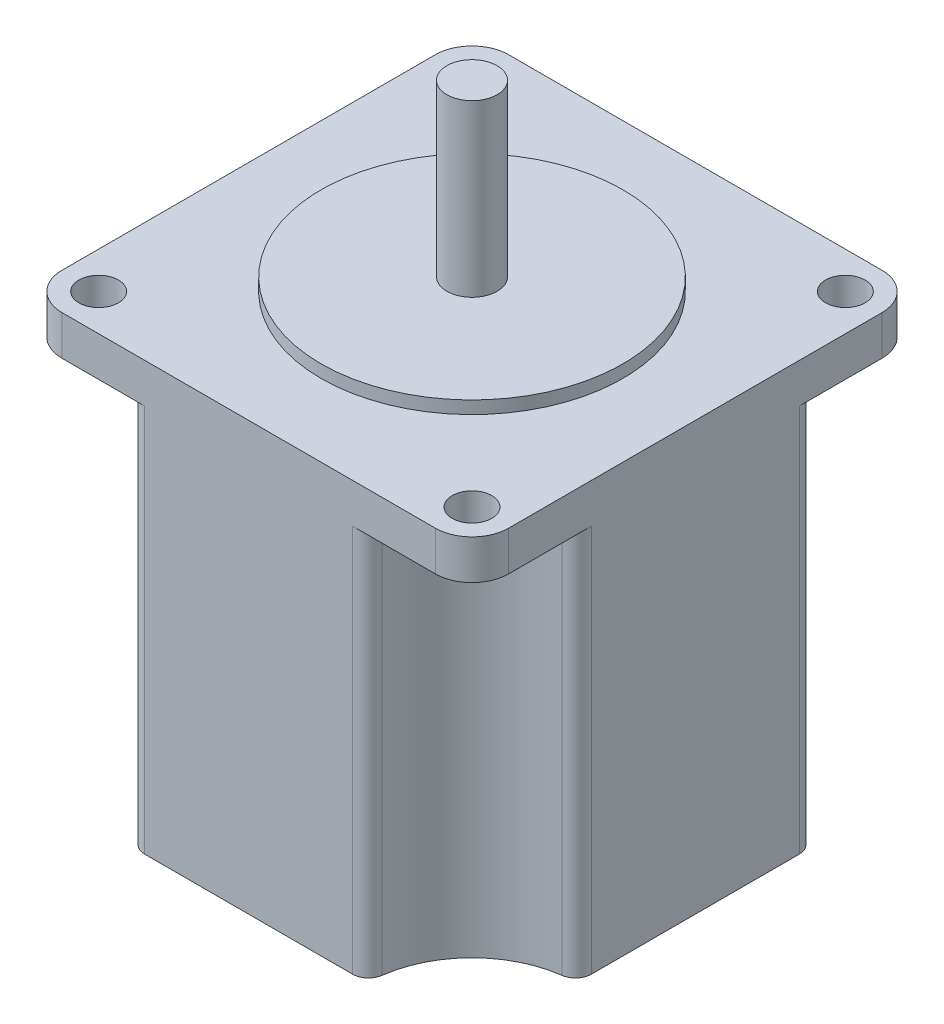
ISO-10303-21;
HEADER;
FILE_DESCRIPTION(('STEP AP214'),'2;1');
FILE_NAME('part.step','',(''),(''),'','','');
FILE_SCHEMA(('AUTOMOTIVE_DESIGN { 1 0 10303 214 1 1 1 1 }'));
ENDSEC;
DATA;
#1=APPLICATION_CONTEXT('core data for automotive mechanical design processes');
#2=APPLICATION_PROTOCOL_DEFINITION('international standard','automotive_design',2000,#1);
#3=PRODUCT_CONTEXT('',#1,'mechanical');
#4=PRODUCT('Part','Part','',(#3));
#5=PRODUCT_RELATED_PRODUCT_CATEGORY('part','',(#4));
#6=PRODUCT_DEFINITION_FORMATION('','',#4);
#7=PRODUCT_DEFINITION_CONTEXT('part definition',#1,'design');
#8=PRODUCT_DEFINITION('design','',#6,#7);
#9=PRODUCT_DEFINITION_SHAPE('','',#8);
#10=(LENGTH_UNIT() NAMED_UNIT(*) SI_UNIT(.MILLI.,.METRE.));
#11=(NAMED_UNIT(*) PLANE_ANGLE_UNIT() SI_UNIT($,.RADIAN.));
#12=(NAMED_UNIT(*) SI_UNIT($,.STERADIAN.) SOLID_ANGLE_UNIT());
#13=UNCERTAINTY_MEASURE_WITH_UNIT(LENGTH_MEASURE(1.E-05),#10,'distance_accuracy_value','');
#14=(GEOMETRIC_REPRESENTATION_CONTEXT(3) GLOBAL_UNCERTAINTY_ASSIGNED_CONTEXT((#13)) GLOBAL_UNIT_ASSIGNED_CONTEXT((#10,
#11,#12)) REPRESENTATION_CONTEXT('',''));
#15=CARTESIAN_POINT('',(0.,0.,0.));
#16=DIRECTION('',(0.,0.,1.));
#17=DIRECTION('',(1.,0.,0.));
#18=AXIS2_PLACEMENT_3D('',#15,#16,#17);
#19=CARTESIAN_POINT('',(28.2,55.6,-28.2));
#20=DIRECTION('',(0.,1.,0.));
#21=DIRECTION('',(0.,0.,1.));
#22=AXIS2_PLACEMENT_3D('',#19,#20,#21);
#23=PLANE('',#22);
#24=CARTESIAN_POINT('',(28.2,55.6,-28.2));
#25=DIRECTION('',(0.,1.,0.));
#26=DIRECTION('',(0.,0.,1.));
#27=AXIS2_PLACEMENT_3D('',#24,#25,#26);
#28=CIRCLE('',#27,19.05);
#29=CARTESIAN_POINT('',(28.2,55.6,-9.14999999999999));
#30=VERTEX_POINT('',#29);
#31=EDGE_CURVE('E367',#30,#30,#28,.T.);
#32=ORIENTED_EDGE('',*,*,#31,.T.);
#33=EDGE_LOOP('',(#32));
#34=FACE_BOUND('',#33,.T.);
#35=CARTESIAN_POINT('',(28.2,55.6,-28.2));
#36=DIRECTION('',(0.,1.,0.));
#37=DIRECTION('',(0.,0.,1.));
#38=AXIS2_PLACEMENT_3D('',#35,#36,#37);
#39=CIRCLE('',#38,3.175);
#40=CARTESIAN_POINT('',(28.2,55.6,-25.025));
#41=VERTEX_POINT('',#40);
#42=EDGE_CURVE('E623',#41,#41,#39,.T.);
#43=ORIENTED_EDGE('',*,*,#42,.F.);
#44=EDGE_LOOP('',(#43));
#45=FACE_BOUND('',#44,.T.);
#46=ADVANCED_FACE('F34',(#34,#45),#23,.T.);
#47=CARTESIAN_POINT('',(4.63,54.,-51.77));
#48=DIRECTION('',(0.,1.,0.));
#49=DIRECTION('',(0.,0.,1.));
#50=AXIS2_PLACEMENT_3D('',#47,#48,#49);
#51=PLANE('',#50);
#52=CARTESIAN_POINT('',(4.63,54.,-51.77));
#53=DIRECTION('',(0.,1.,0.));
#54=DIRECTION('',(0.,0.,1.));
#55=AXIS2_PLACEMENT_3D('',#52,#53,#54);
#56=CIRCLE('',#55,4.63);
#57=CARTESIAN_POINT('',(4.63,54.,-56.4));
#58=VERTEX_POINT('',#57);
#59=CARTESIAN_POINT('',(0.,54.,-51.77));
#60=VERTEX_POINT('',#59);
#61=EDGE_CURVE('E269',#58,#60,#56,.T.);
#62=ORIENTED_EDGE('',*,*,#61,.T.);
#63=DIRECTION('',(0.,0.,1.));
#64=VECTOR('',#63,1.);
#65=CARTESIAN_POINT('',(0.,54.,-51.77));
#66=LINE('',#65,#64);
#67=CARTESIAN_POINT('',(0.,54.,-4.63));
#68=VERTEX_POINT('',#67);
#69=EDGE_CURVE('E272',#60,#68,#66,.T.);
#70=ORIENTED_EDGE('',*,*,#69,.T.);
#71=CARTESIAN_POINT('',(4.63,54.,-4.63));
#72=DIRECTION('',(0.,1.,0.));
#73=DIRECTION('',(0.,0.,-1.));
#74=AXIS2_PLACEMENT_3D('',#71,#72,#73);
#75=CIRCLE('',#74,4.63);
#76=CARTESIAN_POINT('',(4.63,54.,0.));
#77=VERTEX_POINT('',#76);
#78=EDGE_CURVE('E275',#68,#77,#75,.T.);
#79=ORIENTED_EDGE('',*,*,#78,.T.);
#80=DIRECTION('',(1.,0.,0.));
#81=VECTOR('',#80,1.);
#82=CARTESIAN_POINT('',(4.63,54.,0.));
#83=LINE('',#82,#81);
#84=CARTESIAN_POINT('',(51.77,54.,0.));
#85=VERTEX_POINT('',#84);
#86=EDGE_CURVE('E277',#77,#85,#83,.T.);
#87=ORIENTED_EDGE('',*,*,#86,.T.);
#88=CARTESIAN_POINT('',(51.77,54.,-4.63));
#89=DIRECTION('',(0.,1.,0.));
#90=DIRECTION('',(0.,0.,1.));
#91=AXIS2_PLACEMENT_3D('',#88,#89,#90);
#92=CIRCLE('',#91,4.63);
#93=CARTESIAN_POINT('',(56.4,54.,-4.63));
#94=VERTEX_POINT('',#93);
#95=EDGE_CURVE('E279',#85,#94,#92,.T.);
#96=ORIENTED_EDGE('',*,*,#95,.T.);
#97=DIRECTION('',(0.,0.,-1.));
#98=VECTOR('',#97,1.);
#99=CARTESIAN_POINT('',(56.4,54.,-51.77));
#100=LINE('',#99,#98);
#101=CARTESIAN_POINT('',(56.4,54.,-51.77));
#102=VERTEX_POINT('',#101);
#103=EDGE_CURVE('E281',#94,#102,#100,.T.);
#104=ORIENTED_EDGE('',*,*,#103,.T.);
#105=CARTESIAN_POINT('',(51.77,54.,-51.77));
#106=DIRECTION('',(0.,1.,0.));
#107=DIRECTION('',(0.,0.,-1.));
#108=AXIS2_PLACEMENT_3D('',#105,#106,#107);
#109=CIRCLE('',#108,4.63);
#110=CARTESIAN_POINT('',(51.77,54.,-56.4));
#111=VERTEX_POINT('',#110);
#112=EDGE_CURVE('E283',#102,#111,#109,.T.);
#113=ORIENTED_EDGE('',*,*,#112,.T.);
#114=DIRECTION('',(-1.,0.,0.));
#115=VECTOR('',#114,1.);
#116=CARTESIAN_POINT('',(4.63,54.,-56.4));
#117=LINE('',#116,#115);
#118=EDGE_CURVE('E285',#111,#58,#117,.T.);
#119=ORIENTED_EDGE('',*,*,#118,.T.);
#120=EDGE_LOOP('',(#62,#70,#79,#87,#96,#104,#113,#119));
#121=FACE_BOUND('',#120,.T.);
#122=CARTESIAN_POINT('',(4.63,54.,-51.77));
#123=DIRECTION('',(0.,1.,0.));
#124=DIRECTION('',(0.,0.,1.));
#125=AXIS2_PLACEMENT_3D('',#122,#123,#124);
#126=CIRCLE('',#125,2.5);
#127=CARTESIAN_POINT('',(4.63,54.,-49.27));
#128=VERTEX_POINT('',#127);
#129=EDGE_CURVE('E266',#128,#128,#126,.T.);
#130=ORIENTED_EDGE('',*,*,#129,.F.);
#131=EDGE_LOOP('',(#130));
#132=FACE_BOUND('',#131,.T.);
#133=CARTESIAN_POINT('',(51.77,54.,-51.77));
#134=DIRECTION('',(0.,1.,0.));
#135=DIRECTION('',(0.,0.,-1.));
#136=AXIS2_PLACEMENT_3D('',#133,#134,#135);
#137=CIRCLE('',#136,2.5);
#138=CARTESIAN_POINT('',(51.77,54.,-54.27));
#139=VERTEX_POINT('',#138);
#140=EDGE_CURVE('E263',#139,#139,#137,.T.);
#141=ORIENTED_EDGE('',*,*,#140,.F.);
#142=EDGE_LOOP('',(#141));
#143=FACE_BOUND('',#142,.T.);
#144=CARTESIAN_POINT('',(51.77,54.,-4.63000000000001));
#145=DIRECTION('',(0.,1.,0.));
#146=DIRECTION('',(0.,0.,1.));
#147=AXIS2_PLACEMENT_3D('',#144,#145,#146);
#148=CIRCLE('',#147,2.5);
#149=CARTESIAN_POINT('',(51.77,54.,-2.13000000000001));
#150=VERTEX_POINT('',#149);
#151=EDGE_CURVE('E260',#150,#150,#148,.T.);
#152=ORIENTED_EDGE('',*,*,#151,.F.);
#153=EDGE_LOOP('',(#152));
#154=FACE_BOUND('',#153,.T.);
#155=CARTESIAN_POINT('',(4.63,54.,-4.63));
#156=DIRECTION('',(0.,1.,0.));
#157=DIRECTION('',(0.,0.,-1.));
#158=AXIS2_PLACEMENT_3D('',#155,#156,#157);
#159=CIRCLE('',#158,2.5);
#160=CARTESIAN_POINT('',(4.63,54.,-7.13));
#161=VERTEX_POINT('',#160);
#162=EDGE_CURVE('E208',#161,#161,#159,.T.);
#163=ORIENTED_EDGE('',*,*,#162,.F.);
#164=EDGE_LOOP('',(#163));
#165=FACE_BOUND('',#164,.T.);
#166=CARTESIAN_POINT('',(28.2,54.,-28.2));
#167=DIRECTION('',(0.,1.,0.));
#168=DIRECTION('',(0.,0.,1.));
#169=AXIS2_PLACEMENT_3D('',#166,#167,#168);
#170=CIRCLE('',#169,19.05);
#171=CARTESIAN_POINT('',(28.2,54.,-9.14999999999999));
#172=VERTEX_POINT('',#171);
#173=EDGE_CURVE('E622',#172,#172,#170,.T.);
#174=ORIENTED_EDGE('',*,*,#173,.F.);
#175=EDGE_LOOP('',(#174));
#176=FACE_BOUND('',#175,.T.);
#177=ADVANCED_FACE('F322',(#121,#132,#143,#154,#165,#176),#51,.T.);
#178=CARTESIAN_POINT('',(4.63,54.,-51.77));
#179=DIRECTION('',(0.,-1.,0.));
#180=DIRECTION('',(0.,0.,-1.));
#181=AXIS2_PLACEMENT_3D('',#178,#179,#180);
#182=CYLINDRICAL_SURFACE('',#181,4.63);
#183=CARTESIAN_POINT('',(4.63,49.,-51.77));
#184=DIRECTION('',(0.,-1.,0.));
#185=DIRECTION('',(0.,0.,-1.));
#186=AXIS2_PLACEMENT_3D('',#183,#184,#185);
#187=CIRCLE('',#186,4.63);
#188=CARTESIAN_POINT('',(0.,49.,-51.77));
#189=VERTEX_POINT('',#188);
#190=CARTESIAN_POINT('',(4.63,49.,-56.4));
#191=VERTEX_POINT('',#190);
#192=EDGE_CURVE('E250',#189,#191,#187,.T.);
#193=ORIENTED_EDGE('',*,*,#192,.F.);
#194=DIRECTION('',(0.,-1.,0.));
#195=VECTOR('',#194,1.);
#196=CARTESIAN_POINT('',(0.,54.,-51.77));
#197=LINE('',#196,#195);
#198=EDGE_CURVE('E12',#60,#189,#197,.T.);
#199=ORIENTED_EDGE('',*,*,#198,.F.);
#200=ORIENTED_EDGE('',*,*,#61,.F.);
#201=DIRECTION('',(0.,-1.,0.));
#202=VECTOR('',#201,1.);
#203=CARTESIAN_POINT('',(4.63,54.,-56.4));
#204=LINE('',#203,#202);
#205=EDGE_CURVE('E287',#58,#191,#204,.T.);
#206=ORIENTED_EDGE('',*,*,#205,.T.);
#207=EDGE_LOOP('',(#193,#199,#200,#206));
#208=FACE_BOUND('',#207,.T.);
#209=ADVANCED_FACE('F36',(#208),#182,.T.);
#210=CARTESIAN_POINT('',(0.,54.,-51.77));
#211=DIRECTION('',(1.,0.,0.));
#212=DIRECTION('',(0.,0.,-1.));
#213=AXIS2_PLACEMENT_3D('',#210,#211,#212);
#214=PLANE('',#213);
#215=DIRECTION('',(0.,-1.,0.));
#216=VECTOR('',#215,1.);
#217=CARTESIAN_POINT('',(0.,49.,-15.0678465614699));
#218=LINE('',#217,#216);
#219=CARTESIAN_POINT('',(0.,49.,-15.0678465614699));
#220=VERTEX_POINT('',#219);
#221=CARTESIAN_POINT('',(0.,0.,-15.0678465614699));
#222=VERTEX_POINT('',#221);
#223=EDGE_CURVE('E214',#220,#222,#218,.T.);
#224=ORIENTED_EDGE('',*,*,#223,.F.);
#225=DIRECTION('',(0.,0.,-1.));
#226=VECTOR('',#225,1.);
#227=CARTESIAN_POINT('',(0.,49.,-51.77));
#228=LINE('',#227,#226);
#229=CARTESIAN_POINT('',(0.,49.,-4.63));
#230=VERTEX_POINT('',#229);
#231=EDGE_CURVE('E196',#230,#220,#228,.T.);
#232=ORIENTED_EDGE('',*,*,#231,.F.);
#233=DIRECTION('',(0.,-1.,0.));
#234=VECTOR('',#233,1.);
#235=CARTESIAN_POINT('',(0.,54.,-4.63));
#236=LINE('',#235,#234);
#237=EDGE_CURVE('E43',#68,#230,#236,.T.);
#238=ORIENTED_EDGE('',*,*,#237,.F.);
#239=ORIENTED_EDGE('',*,*,#69,.F.);
#240=ORIENTED_EDGE('',*,*,#198,.T.);
#241=CARTESIAN_POINT('',(0.,49.,-41.3321534385301));
#242=VERTEX_POINT('',#241);
#243=EDGE_CURVE('E210',#242,#189,#228,.T.);
#244=ORIENTED_EDGE('',*,*,#243,.F.);
#245=DIRECTION('',(0.,-1.,0.));
#246=VECTOR('',#245,1.);
#247=CARTESIAN_POINT('',(0.,49.,-41.3321534385301));
#248=LINE('',#247,#246);
#249=CARTESIAN_POINT('',(0.,0.,-41.3321534385301));
#250=VERTEX_POINT('',#249);
#251=EDGE_CURVE('E224',#242,#250,#248,.T.);
#252=ORIENTED_EDGE('',*,*,#251,.T.);
#253=DIRECTION('',(0.,0.,1.));
#254=VECTOR('',#253,1.);
#255=CARTESIAN_POINT('',(0.,0.,-51.77));
#256=LINE('',#255,#254);
#257=EDGE_CURVE('E223',#250,#222,#256,.T.);
#258=ORIENTED_EDGE('',*,*,#257,.T.);
#259=EDGE_LOOP('',(#224,#232,#238,#239,#240,#244,#252,#258));
#260=FACE_BOUND('',#259,.T.);
#261=ADVANCED_FACE('F220',(#260),#214,.F.);
#262=CARTESIAN_POINT('',(4.63,54.,-4.63));
#263=DIRECTION('',(0.,-1.,0.));
#264=DIRECTION('',(0.,0.,-1.));
#265=AXIS2_PLACEMENT_3D('',#262,#263,#264);
#266=CYLINDRICAL_SURFACE('',#265,4.63);
#267=CARTESIAN_POINT('',(4.63,49.,-4.63));
#268=DIRECTION('',(0.,-1.,0.));
#269=DIRECTION('',(0.,0.,-1.));
#270=AXIS2_PLACEMENT_3D('',#267,#268,#269);
#271=CIRCLE('',#270,4.63);
#272=CARTESIAN_POINT('',(4.63,49.,0.));
#273=VERTEX_POINT('',#272);
#274=EDGE_CURVE('E203',#273,#230,#271,.T.);
#275=ORIENTED_EDGE('',*,*,#274,.F.);
#276=DIRECTION('',(0.,-1.,0.));
#277=VECTOR('',#276,1.);
#278=CARTESIAN_POINT('',(4.63,54.,0.));
#279=LINE('',#278,#277);
#280=EDGE_CURVE('E311',#77,#273,#279,.T.);
#281=ORIENTED_EDGE('',*,*,#280,.F.);
#282=ORIENTED_EDGE('',*,*,#78,.F.);
#283=ORIENTED_EDGE('',*,*,#237,.T.);
#284=EDGE_LOOP('',(#275,#281,#282,#283));
#285=FACE_BOUND('',#284,.T.);
#286=ADVANCED_FACE('F316',(#285),#266,.T.);
#287=CARTESIAN_POINT('',(51.77,54.,-4.63));
#288=DIRECTION('',(0.,-1.,0.));
#289=DIRECTION('',(0.,0.,-1.));
#290=AXIS2_PLACEMENT_3D('',#287,#288,#289);
#291=CYLINDRICAL_SURFACE('',#290,4.63);
#292=CARTESIAN_POINT('',(51.77,49.,-4.63));
#293=DIRECTION('',(0.,-1.,0.));
#294=DIRECTION('',(0.,0.,-1.));
#295=AXIS2_PLACEMENT_3D('',#292,#293,#294);
#296=CIRCLE('',#295,4.63);
#297=CARTESIAN_POINT('',(56.4,49.,-4.63));
#298=VERTEX_POINT('',#297);
#299=CARTESIAN_POINT('',(51.77,49.,0.));
#300=VERTEX_POINT('',#299);
#301=EDGE_CURVE('E252',#298,#300,#296,.T.);
#302=ORIENTED_EDGE('',*,*,#301,.F.);
#303=DIRECTION('',(0.,-1.,0.));
#304=VECTOR('',#303,1.);
#305=CARTESIAN_POINT('',(56.4,54.,-4.63));
#306=LINE('',#305,#304);
#307=EDGE_CURVE('E305',#94,#298,#306,.T.);
#308=ORIENTED_EDGE('',*,*,#307,.F.);
#309=ORIENTED_EDGE('',*,*,#95,.F.);
#310=DIRECTION('',(0.,-1.,0.));
#311=VECTOR('',#310,1.);
#312=CARTESIAN_POINT('',(51.77,54.,0.));
#313=LINE('',#312,#311);
#314=EDGE_CURVE('E308',#85,#300,#313,.T.);
#315=ORIENTED_EDGE('',*,*,#314,.T.);
#316=EDGE_LOOP('',(#302,#308,#309,#315));
#317=FACE_BOUND('',#316,.T.);
#318=ADVANCED_FACE('F459',(#317),#291,.T.);
#319=CARTESIAN_POINT('',(51.77,54.,-51.77));
#320=DIRECTION('',(0.,-1.,0.));
#321=DIRECTION('',(0.,0.,-1.));
#322=AXIS2_PLACEMENT_3D('',#319,#320,#321);
#323=CYLINDRICAL_SURFACE('',#322,4.63);
#324=CARTESIAN_POINT('',(51.77,49.,-51.77));
#325=DIRECTION('',(0.,-1.,0.));
#326=DIRECTION('',(0.,0.,-1.));
#327=AXIS2_PLACEMENT_3D('',#324,#325,#326);
#328=CIRCLE('',#327,4.63);
#329=CARTESIAN_POINT('',(51.77,49.,-56.4));
#330=VERTEX_POINT('',#329);
#331=CARTESIAN_POINT('',(56.4,49.,-51.77));
#332=VERTEX_POINT('',#331);
#333=EDGE_CURVE('E244',#330,#332,#328,.T.);
#334=ORIENTED_EDGE('',*,*,#333,.F.);
#335=DIRECTION('',(0.,-1.,0.));
#336=VECTOR('',#335,1.);
#337=CARTESIAN_POINT('',(51.77,54.,-56.4));
#338=LINE('',#337,#336);
#339=EDGE_CURVE('E299',#111,#330,#338,.T.);
#340=ORIENTED_EDGE('',*,*,#339,.F.);
#341=ORIENTED_EDGE('',*,*,#112,.F.);
#342=DIRECTION('',(0.,-1.,0.));
#343=VECTOR('',#342,1.);
#344=CARTESIAN_POINT('',(56.4,54.,-51.77));
#345=LINE('',#344,#343);
#346=EDGE_CURVE('E302',#102,#332,#345,.T.);
#347=ORIENTED_EDGE('',*,*,#346,.T.);
#348=EDGE_LOOP('',(#334,#340,#341,#347));
#349=FACE_BOUND('',#348,.T.);
#350=ADVANCED_FACE('F469',(#349),#323,.T.);
#351=CARTESIAN_POINT('',(4.63,0.,-51.77));
#352=DIRECTION('',(0.,1.,0.));
#353=DIRECTION('',(0.,0.,1.));
#354=AXIS2_PLACEMENT_3D('',#351,#352,#353);
#355=PLANE('',#354);
#356=CARTESIAN_POINT('',(2.,0.,-15.0678465614699));
#357=DIRECTION('',(0.,-1.,0.));
#358=DIRECTION('',(0.,0.,-1.));
#359=AXIS2_PLACEMENT_3D('',#356,#357,#358);
#360=CIRCLE('',#359,2.);
#361=CARTESIAN_POINT('',(1.73684210526316,0.,-13.0852351718028));
#362=VERTEX_POINT('',#361);
#363=EDGE_CURVE('E363',#362,#222,#360,.T.);
#364=ORIENTED_EDGE('',*,*,#363,.T.);
#365=ORIENTED_EDGE('',*,*,#257,.F.);
#366=CARTESIAN_POINT('',(2.,0.,-41.3321534385301));
#367=DIRECTION('',(0.,-1.,0.));
#368=DIRECTION('',(0.,0.,1.));
#369=AXIS2_PLACEMENT_3D('',#366,#367,#368);
#370=CIRCLE('',#369,2.);
#371=CARTESIAN_POINT('',(1.73684210526316,0.,-43.3147648281972));
#372=VERTEX_POINT('',#371);
#373=EDGE_CURVE('E355',#250,#372,#370,.T.);
#374=ORIENTED_EDGE('',*,*,#373,.T.);
#375=CARTESIAN_POINT('',(0.,0.,-56.4));
#376=DIRECTION('',(0.,1.,0.));
#377=DIRECTION('',(0.,0.,1.));
#378=AXIS2_PLACEMENT_3D('',#375,#376,#377);
#379=CIRCLE('',#378,13.2);
#380=CARTESIAN_POINT('',(13.0852351718028,0.,-54.6631578947368));
#381=VERTEX_POINT('',#380);
#382=EDGE_CURVE('E362',#372,#381,#379,.T.);
#383=ORIENTED_EDGE('',*,*,#382,.T.);
#384=CARTESIAN_POINT('',(15.0678465614699,0.,-54.4));
#385=DIRECTION('',(0.,-1.,0.));
#386=DIRECTION('',(0.,0.,1.));
#387=AXIS2_PLACEMENT_3D('',#384,#385,#386);
#388=CIRCLE('',#387,2.);
#389=CARTESIAN_POINT('',(15.0678465614699,0.,-56.4));
#390=VERTEX_POINT('',#389);
#391=EDGE_CURVE('E365',#381,#390,#388,.T.);
#392=ORIENTED_EDGE('',*,*,#391,.T.);
#393=DIRECTION('',(-1.,0.,0.));
#394=VECTOR('',#393,1.);
#395=CARTESIAN_POINT('',(4.63,0.,-56.4));
#396=LINE('',#395,#394);
#397=CARTESIAN_POINT('',(41.3321534385301,0.,-56.4));
#398=VERTEX_POINT('',#397);
#399=EDGE_CURVE('E273',#398,#390,#396,.T.);
#400=ORIENTED_EDGE('',*,*,#399,.F.);
#401=CARTESIAN_POINT('',(41.3321534385301,0.,-54.4));
#402=DIRECTION('',(0.,-1.,0.));
#403=DIRECTION('',(0.,0.,-1.));
#404=AXIS2_PLACEMENT_3D('',#401,#402,#403);
#405=CIRCLE('',#404,2.);
#406=CARTESIAN_POINT('',(43.3147648281972,0.,-54.6631578947368));
#407=VERTEX_POINT('',#406);
#408=EDGE_CURVE('E371',#398,#407,#405,.T.);
#409=ORIENTED_EDGE('',*,*,#408,.T.);
#410=CARTESIAN_POINT('',(56.4,0.,-56.4));
#411=DIRECTION('',(0.,1.,0.));
#412=DIRECTION('',(0.,0.,-1.));
#413=AXIS2_PLACEMENT_3D('',#410,#411,#412);
#414=CIRCLE('',#413,13.2);
#415=CARTESIAN_POINT('',(54.6631578947368,0.,-43.3147648281972));
#416=VERTEX_POINT('',#415);
#417=EDGE_CURVE('E374',#407,#416,#414,.T.);
#418=ORIENTED_EDGE('',*,*,#417,.T.);
#419=CARTESIAN_POINT('',(54.4,0.,-41.3321534385301));
#420=DIRECTION('',(0.,-1.,0.));
#421=DIRECTION('',(0.,0.,-1.));
#422=AXIS2_PLACEMENT_3D('',#419,#420,#421);
#423=CIRCLE('',#422,2.);
#424=CARTESIAN_POINT('',(56.4,0.,-41.3321534385301));
#425=VERTEX_POINT('',#424);
#426=EDGE_CURVE('E377',#416,#425,#423,.T.);
#427=ORIENTED_EDGE('',*,*,#426,.T.);
#428=DIRECTION('',(0.,0.,-1.));
#429=VECTOR('',#428,1.);
#430=CARTESIAN_POINT('',(56.4,0.,-51.77));
#431=LINE('',#430,#429);
#432=CARTESIAN_POINT('',(56.4,0.,-15.0678465614699));
#433=VERTEX_POINT('',#432);
#434=EDGE_CURVE('E292',#433,#425,#431,.T.);
#435=ORIENTED_EDGE('',*,*,#434,.F.);
#436=CARTESIAN_POINT('',(54.4,0.,-15.0678465614699));
#437=DIRECTION('',(0.,-1.,0.));
#438=DIRECTION('',(0.,0.,1.));
#439=AXIS2_PLACEMENT_3D('',#436,#437,#438);
#440=CIRCLE('',#439,2.);
#441=CARTESIAN_POINT('',(54.6631578947368,0.,-13.0852351718028));
#442=VERTEX_POINT('',#441);
#443=EDGE_CURVE('E380',#433,#442,#440,.T.);
#444=ORIENTED_EDGE('',*,*,#443,.T.);
#445=CARTESIAN_POINT('',(56.4,0.,0.));
#446=DIRECTION('',(0.,1.,0.));
#447=DIRECTION('',(0.,0.,1.));
#448=AXIS2_PLACEMENT_3D('',#445,#446,#447);
#449=CIRCLE('',#448,13.2);
#450=CARTESIAN_POINT('',(43.3147648281972,0.,-1.73684210526315));
#451=VERTEX_POINT('',#450);
#452=EDGE_CURVE('E58',#442,#451,#449,.T.);
#453=ORIENTED_EDGE('',*,*,#452,.T.);
#454=CARTESIAN_POINT('',(41.3321534385301,0.,-1.99999999999999));
#455=DIRECTION('',(0.,-1.,0.));
#456=DIRECTION('',(0.,0.,1.));
#457=AXIS2_PLACEMENT_3D('',#454,#455,#456);
#458=CIRCLE('',#457,2.);
#459=CARTESIAN_POINT('',(41.3321534385301,0.,0.));
#460=VERTEX_POINT('',#459);
#461=EDGE_CURVE('E384',#451,#460,#458,.T.);
#462=ORIENTED_EDGE('',*,*,#461,.T.);
#463=DIRECTION('',(1.,0.,0.));
#464=VECTOR('',#463,1.);
#465=CARTESIAN_POINT('',(4.63,0.,0.));
#466=LINE('',#465,#464);
#467=CARTESIAN_POINT('',(15.0678465614699,0.,0.));
#468=VERTEX_POINT('',#467);
#469=EDGE_CURVE('E289',#468,#460,#466,.T.);
#470=ORIENTED_EDGE('',*,*,#469,.F.);
#471=CARTESIAN_POINT('',(15.0678465614699,0.,-2.));
#472=DIRECTION('',(0.,-1.,0.));
#473=DIRECTION('',(0.,0.,-1.));
#474=AXIS2_PLACEMENT_3D('',#471,#472,#473);
#475=CIRCLE('',#474,2.);
#476=CARTESIAN_POINT('',(13.0852351718028,0.,-1.73684210526316));
#477=VERTEX_POINT('',#476);
#478=EDGE_CURVE('E387',#468,#477,#475,.T.);
#479=ORIENTED_EDGE('',*,*,#478,.T.);
#480=CARTESIAN_POINT('',(0.,0.,0.));
#481=DIRECTION('',(0.,1.,0.));
#482=DIRECTION('',(0.,0.,-1.));
#483=AXIS2_PLACEMENT_3D('',#480,#481,#482);
#484=CIRCLE('',#483,13.2);
#485=EDGE_CURVE('E50',#477,#362,#484,.T.);
#486=ORIENTED_EDGE('',*,*,#485,.T.);
#487=EDGE_LOOP('',(#364,#365,#374,#383,#392,#400,#409,#418,#427,#435,#444,#453,#462,#470,#479,#486));
#488=FACE_BOUND('',#487,.T.);
#489=ADVANCED_FACE('F361',(#488),#355,.F.);
#490=CARTESIAN_POINT('',(4.63,0.,-51.77));
#491=DIRECTION('',(0.,1.,0.));
#492=DIRECTION('',(0.,0.,1.));
#493=AXIS2_PLACEMENT_3D('',#490,#491,#492);
#494=CYLINDRICAL_SURFACE('',#493,2.5);
#495=ORIENTED_EDGE('',*,*,#129,.T.);
#496=EDGE_LOOP('',(#495));
#497=FACE_BOUND('',#496,.T.);
#498=CARTESIAN_POINT('',(4.63,49.,-51.77));
#499=DIRECTION('',(0.,-1.,0.));
#500=DIRECTION('',(0.,0.,-1.));
#501=AXIS2_PLACEMENT_3D('',#498,#499,#500);
#502=CIRCLE('',#501,2.5);
#503=CARTESIAN_POINT('',(4.63,49.,-54.27));
#504=VERTEX_POINT('',#503);
#505=EDGE_CURVE('E239',#504,#504,#502,.F.);
#506=ORIENTED_EDGE('',*,*,#505,.F.);
#507=EDGE_LOOP('',(#506));
#508=FACE_BOUND('',#507,.T.);
#509=ADVANCED_FACE('F548',(#497,#508),#494,.F.);
#510=CARTESIAN_POINT('',(51.77,0.,-51.77));
#511=DIRECTION('',(0.,1.,0.));
#512=DIRECTION('',(0.,0.,1.));
#513=AXIS2_PLACEMENT_3D('',#510,#511,#512);
#514=CYLINDRICAL_SURFACE('',#513,2.5);
#515=ORIENTED_EDGE('',*,*,#140,.T.);
#516=EDGE_LOOP('',(#515));
#517=FACE_BOUND('',#516,.T.);
#518=CARTESIAN_POINT('',(51.77,49.,-51.77));
#519=DIRECTION('',(0.,-1.,0.));
#520=DIRECTION('',(0.,0.,-1.));
#521=AXIS2_PLACEMENT_3D('',#518,#519,#520);
#522=CIRCLE('',#521,2.5);
#523=CARTESIAN_POINT('',(51.77,49.,-54.27));
#524=VERTEX_POINT('',#523);
#525=EDGE_CURVE('E236',#524,#524,#522,.F.);
#526=ORIENTED_EDGE('',*,*,#525,.F.);
#527=EDGE_LOOP('',(#526));
#528=FACE_BOUND('',#527,.T.);
#529=ADVANCED_FACE('F550',(#517,#528),#514,.F.);
#530=CARTESIAN_POINT('',(51.77,0.,-4.63000000000001));
#531=DIRECTION('',(0.,1.,0.));
#532=DIRECTION('',(0.,0.,1.));
#533=AXIS2_PLACEMENT_3D('',#530,#531,#532);
#534=CYLINDRICAL_SURFACE('',#533,2.5);
#535=ORIENTED_EDGE('',*,*,#151,.T.);
#536=EDGE_LOOP('',(#535));
#537=FACE_BOUND('',#536,.T.);
#538=CARTESIAN_POINT('',(51.77,49.,-4.63000000000001));
#539=DIRECTION('',(0.,-1.,0.));
#540=DIRECTION('',(0.,0.,-1.));
#541=AXIS2_PLACEMENT_3D('',#538,#539,#540);
#542=CIRCLE('',#541,2.5);
#543=CARTESIAN_POINT('',(51.77,49.,-7.13000000000001));
#544=VERTEX_POINT('',#543);
#545=EDGE_CURVE('E233',#544,#544,#542,.F.);
#546=ORIENTED_EDGE('',*,*,#545,.F.);
#547=EDGE_LOOP('',(#546));
#548=FACE_BOUND('',#547,.T.);
#549=ADVANCED_FACE('F557',(#537,#548),#534,.F.);
#550=CARTESIAN_POINT('',(4.63,0.,-4.63));
#551=DIRECTION('',(0.,1.,0.));
#552=DIRECTION('',(0.,0.,1.));
#553=AXIS2_PLACEMENT_3D('',#550,#551,#552);
#554=CYLINDRICAL_SURFACE('',#553,2.5);
#555=ORIENTED_EDGE('',*,*,#162,.T.);
#556=EDGE_LOOP('',(#555));
#557=FACE_BOUND('',#556,.T.);
#558=CARTESIAN_POINT('',(4.63,49.,-4.63));
#559=DIRECTION('',(0.,-1.,0.));
#560=DIRECTION('',(0.,0.,-1.));
#561=AXIS2_PLACEMENT_3D('',#558,#559,#560);
#562=CIRCLE('',#561,2.5);
#563=CARTESIAN_POINT('',(4.63,49.,-7.13));
#564=VERTEX_POINT('',#563);
#565=EDGE_CURVE('E38',#564,#564,#562,.F.);
#566=ORIENTED_EDGE('',*,*,#565,.F.);
#567=EDGE_LOOP('',(#566));
#568=FACE_BOUND('',#567,.T.);
#569=ADVANCED_FACE('F571',(#557,#568),#554,.F.);
#570=CARTESIAN_POINT('',(4.63,54.,0.));
#571=DIRECTION('',(0.,0.,-1.));
#572=DIRECTION('',(-1.,0.,0.));
#573=AXIS2_PLACEMENT_3D('',#570,#571,#572);
#574=PLANE('',#573);
#575=DIRECTION('',(0.,-1.,0.));
#576=VECTOR('',#575,1.);
#577=CARTESIAN_POINT('',(41.3321534385301,49.,0.));
#578=LINE('',#577,#576);
#579=CARTESIAN_POINT('',(41.3321534385301,49.,0.));
#580=VERTEX_POINT('',#579);
#581=EDGE_CURVE('E397',#580,#460,#578,.T.);
#582=ORIENTED_EDGE('',*,*,#581,.F.);
#583=DIRECTION('',(-1.,0.,0.));
#584=VECTOR('',#583,1.);
#585=CARTESIAN_POINT('',(4.63,49.,0.));
#586=LINE('',#585,#584);
#587=EDGE_CURVE('E254',#300,#580,#586,.T.);
#588=ORIENTED_EDGE('',*,*,#587,.F.);
#589=ORIENTED_EDGE('',*,*,#314,.F.);
#590=ORIENTED_EDGE('',*,*,#86,.F.);
#591=ORIENTED_EDGE('',*,*,#280,.T.);
#592=CARTESIAN_POINT('',(15.0678465614699,49.,0.));
#593=VERTEX_POINT('',#592);
#594=EDGE_CURVE('E256',#593,#273,#586,.T.);
#595=ORIENTED_EDGE('',*,*,#594,.F.);
#596=DIRECTION('',(0.,-1.,0.));
#597=VECTOR('',#596,1.);
#598=CARTESIAN_POINT('',(15.0678465614699,49.,0.));
#599=LINE('',#598,#597);
#600=EDGE_CURVE('E394',#593,#468,#599,.T.);
#601=ORIENTED_EDGE('',*,*,#600,.T.);
#602=ORIENTED_EDGE('',*,*,#469,.T.);
#603=EDGE_LOOP('',(#582,#588,#589,#590,#591,#595,#601,#602));
#604=FACE_BOUND('',#603,.T.);
#605=ADVANCED_FACE('F448',(#604),#574,.F.);
#606=CARTESIAN_POINT('',(56.4,54.,-51.77));
#607=DIRECTION('',(-1.,0.,0.));
#608=DIRECTION('',(0.,0.,1.));
#609=AXIS2_PLACEMENT_3D('',#606,#607,#608);
#610=PLANE('',#609);
#611=DIRECTION('',(0.,-1.,0.));
#612=VECTOR('',#611,1.);
#613=CARTESIAN_POINT('',(56.4,49.,-41.3321534385301));
#614=LINE('',#613,#612);
#615=CARTESIAN_POINT('',(56.4,49.,-41.3321534385301));
#616=VERTEX_POINT('',#615);
#617=EDGE_CURVE('E406',#616,#425,#614,.T.);
#618=ORIENTED_EDGE('',*,*,#617,.F.);
#619=DIRECTION('',(0.,0.,1.));
#620=VECTOR('',#619,1.);
#621=CARTESIAN_POINT('',(56.4,49.,-51.77));
#622=LINE('',#621,#620);
#623=EDGE_CURVE('E247',#332,#616,#622,.T.);
#624=ORIENTED_EDGE('',*,*,#623,.F.);
#625=ORIENTED_EDGE('',*,*,#346,.F.);
#626=ORIENTED_EDGE('',*,*,#103,.F.);
#627=ORIENTED_EDGE('',*,*,#307,.T.);
#628=CARTESIAN_POINT('',(56.4,49.,-15.0678465614699));
#629=VERTEX_POINT('',#628);
#630=EDGE_CURVE('E249',#629,#298,#622,.T.);
#631=ORIENTED_EDGE('',*,*,#630,.F.);
#632=DIRECTION('',(0.,-1.,0.));
#633=VECTOR('',#632,1.);
#634=CARTESIAN_POINT('',(56.4,49.,-15.0678465614699));
#635=LINE('',#634,#633);
#636=EDGE_CURVE('E403',#629,#433,#635,.T.);
#637=ORIENTED_EDGE('',*,*,#636,.T.);
#638=ORIENTED_EDGE('',*,*,#434,.T.);
#639=EDGE_LOOP('',(#618,#624,#625,#626,#627,#631,#637,#638));
#640=FACE_BOUND('',#639,.T.);
#641=ADVANCED_FACE('F463',(#640),#610,.F.);
#642=CARTESIAN_POINT('',(4.63,54.,-56.4));
#643=DIRECTION('',(0.,0.,1.));
#644=DIRECTION('',(1.,0.,0.));
#645=AXIS2_PLACEMENT_3D('',#642,#643,#644);
#646=PLANE('',#645);
#647=DIRECTION('',(0.,-1.,0.));
#648=VECTOR('',#647,1.);
#649=CARTESIAN_POINT('',(15.0678465614699,49.,-56.4));
#650=LINE('',#649,#648);
#651=CARTESIAN_POINT('',(15.0678465614699,49.,-56.4));
#652=VERTEX_POINT('',#651);
#653=EDGE_CURVE('E336',#652,#390,#650,.T.);
#654=ORIENTED_EDGE('',*,*,#653,.F.);
#655=DIRECTION('',(1.,0.,0.));
#656=VECTOR('',#655,1.);
#657=CARTESIAN_POINT('',(4.63,49.,-56.4));
#658=LINE('',#657,#656);
#659=EDGE_CURVE('E245',#191,#652,#658,.T.);
#660=ORIENTED_EDGE('',*,*,#659,.F.);
#661=ORIENTED_EDGE('',*,*,#205,.F.);
#662=ORIENTED_EDGE('',*,*,#118,.F.);
#663=ORIENTED_EDGE('',*,*,#339,.T.);
#664=CARTESIAN_POINT('',(41.3321534385301,49.,-56.4));
#665=VERTEX_POINT('',#664);
#666=EDGE_CURVE('E242',#665,#330,#658,.T.);
#667=ORIENTED_EDGE('',*,*,#666,.F.);
#668=DIRECTION('',(0.,-1.,0.));
#669=VECTOR('',#668,1.);
#670=CARTESIAN_POINT('',(41.3321534385301,49.,-56.4));
#671=LINE('',#670,#669);
#672=EDGE_CURVE('E342',#665,#398,#671,.T.);
#673=ORIENTED_EDGE('',*,*,#672,.T.);
#674=ORIENTED_EDGE('',*,*,#399,.T.);
#675=EDGE_LOOP('',(#654,#660,#661,#662,#663,#667,#673,#674));
#676=FACE_BOUND('',#675,.T.);
#677=ADVANCED_FACE('F335',(#676),#646,.F.);
#678=CARTESIAN_POINT('',(28.2,49.,-28.2));
#679=DIRECTION('',(0.,-1.,0.));
#680=DIRECTION('',(0.,0.,-1.));
#681=AXIS2_PLACEMENT_3D('',#678,#679,#680);
#682=PLANE('',#681);
#683=ORIENTED_EDGE('',*,*,#565,.T.);
#684=EDGE_LOOP('',(#683));
#685=FACE_BOUND('',#684,.T.);
#686=ORIENTED_EDGE('',*,*,#231,.T.);
#687=CARTESIAN_POINT('',(2.,49.,-15.0678465614699));
#688=DIRECTION('',(0.,-1.,0.));
#689=DIRECTION('',(0.,0.,-1.));
#690=AXIS2_PLACEMENT_3D('',#687,#688,#689);
#691=CIRCLE('',#690,2.);
#692=CARTESIAN_POINT('',(1.73684210526316,49.,-13.0852351718028));
#693=VERTEX_POINT('',#692);
#694=EDGE_CURVE('E200',#693,#220,#691,.T.);
#695=ORIENTED_EDGE('',*,*,#694,.F.);
#696=CARTESIAN_POINT('',(0.,49.,0.));
#697=DIRECTION('',(0.,1.,0.));
#698=DIRECTION('',(0.,0.,-1.));
#699=AXIS2_PLACEMENT_3D('',#696,#697,#698);
#700=CIRCLE('',#699,13.2);
#701=CARTESIAN_POINT('',(13.0852351718028,49.,-1.73684210526316));
#702=VERTEX_POINT('',#701);
#703=EDGE_CURVE('E225',#702,#693,#700,.T.);
#704=ORIENTED_EDGE('',*,*,#703,.F.);
#705=CARTESIAN_POINT('',(15.0678465614699,49.,-2.));
#706=DIRECTION('',(0.,-1.,0.));
#707=DIRECTION('',(0.,0.,-1.));
#708=AXIS2_PLACEMENT_3D('',#705,#706,#707);
#709=CIRCLE('',#708,2.);
#710=EDGE_CURVE('E229',#593,#702,#709,.T.);
#711=ORIENTED_EDGE('',*,*,#710,.F.);
#712=ORIENTED_EDGE('',*,*,#594,.T.);
#713=ORIENTED_EDGE('',*,*,#274,.T.);
#714=EDGE_LOOP('',(#686,#695,#704,#711,#712,#713));
#715=FACE_BOUND('',#714,.T.);
#716=ADVANCED_FACE('F198',(#685,#715),#682,.T.);
#717=CARTESIAN_POINT('',(15.0678465614699,49.,-2.));
#718=DIRECTION('',(0.,-1.,0.));
#719=DIRECTION('',(0.,0.,-1.));
#720=AXIS2_PLACEMENT_3D('',#717,#718,#719);
#721=CYLINDRICAL_SURFACE('',#720,2.);
#722=ORIENTED_EDGE('',*,*,#478,.F.);
#723=ORIENTED_EDGE('',*,*,#600,.F.);
#724=ORIENTED_EDGE('',*,*,#710,.T.);
#725=DIRECTION('',(0.,-1.,0.));
#726=VECTOR('',#725,1.);
#727=CARTESIAN_POINT('',(13.0852351718028,49.,-1.73684210526316));
#728=LINE('',#727,#726);
#729=EDGE_CURVE('E392',#702,#477,#728,.T.);
#730=ORIENTED_EDGE('',*,*,#729,.T.);
#731=EDGE_LOOP('',(#722,#723,#724,#730));
#732=FACE_BOUND('',#731,.T.);
#733=ADVANCED_FACE('F444',(#732),#721,.T.);
#734=CARTESIAN_POINT('',(0.,49.,0.));
#735=DIRECTION('',(0.,-1.,0.));
#736=DIRECTION('',(0.,0.,-1.));
#737=AXIS2_PLACEMENT_3D('',#734,#735,#736);
#738=CYLINDRICAL_SURFACE('',#737,13.2);
#739=ORIENTED_EDGE('',*,*,#485,.F.);
#740=ORIENTED_EDGE('',*,*,#729,.F.);
#741=ORIENTED_EDGE('',*,*,#703,.T.);
#742=DIRECTION('',(0.,-1.,0.));
#743=VECTOR('',#742,1.);
#744=CARTESIAN_POINT('',(1.73684210526316,49.,-13.0852351718028));
#745=LINE('',#744,#743);
#746=EDGE_CURVE('E216',#693,#362,#745,.T.);
#747=ORIENTED_EDGE('',*,*,#746,.T.);
#748=EDGE_LOOP('',(#739,#740,#741,#747));
#749=FACE_BOUND('',#748,.T.);
#750=ADVANCED_FACE('F517',(#749),#738,.F.);
#751=CARTESIAN_POINT('',(2.,49.,-15.0678465614699));
#752=DIRECTION('',(0.,-1.,0.));
#753=DIRECTION('',(0.,0.,-1.));
#754=AXIS2_PLACEMENT_3D('',#751,#752,#753);
#755=CYLINDRICAL_SURFACE('',#754,2.);
#756=ORIENTED_EDGE('',*,*,#363,.F.);
#757=ORIENTED_EDGE('',*,*,#746,.F.);
#758=ORIENTED_EDGE('',*,*,#694,.T.);
#759=ORIENTED_EDGE('',*,*,#223,.T.);
#760=EDGE_LOOP('',(#756,#757,#758,#759));
#761=FACE_BOUND('',#760,.T.);
#762=ADVANCED_FACE('F213',(#761),#755,.T.);
#763=ORIENTED_EDGE('',*,*,#545,.T.);
#764=EDGE_LOOP('',(#763));
#765=FACE_BOUND('',#764,.T.);
#766=ORIENTED_EDGE('',*,*,#587,.T.);
#767=CARTESIAN_POINT('',(41.3321534385301,49.,-1.99999999999999));
#768=DIRECTION('',(0.,-1.,0.));
#769=DIRECTION('',(0.,0.,1.));
#770=AXIS2_PLACEMENT_3D('',#767,#768,#769);
#771=CIRCLE('',#770,2.);
#772=CARTESIAN_POINT('',(43.3147648281972,49.,-1.73684210526315));
#773=VERTEX_POINT('',#772);
#774=EDGE_CURVE('E438',#773,#580,#771,.T.);
#775=ORIENTED_EDGE('',*,*,#774,.F.);
#776=CARTESIAN_POINT('',(56.4,49.,0.));
#777=DIRECTION('',(0.,1.,0.));
#778=DIRECTION('',(0.,0.,1.));
#779=AXIS2_PLACEMENT_3D('',#776,#777,#778);
#780=CIRCLE('',#779,13.2);
#781=CARTESIAN_POINT('',(54.6631578947368,49.,-13.0852351718028));
#782=VERTEX_POINT('',#781);
#783=EDGE_CURVE('E435',#782,#773,#780,.T.);
#784=ORIENTED_EDGE('',*,*,#783,.F.);
#785=CARTESIAN_POINT('',(54.4,49.,-15.0678465614699));
#786=DIRECTION('',(0.,-1.,0.));
#787=DIRECTION('',(0.,0.,1.));
#788=AXIS2_PLACEMENT_3D('',#785,#786,#787);
#789=CIRCLE('',#788,2.);
#790=EDGE_CURVE('E432',#629,#782,#789,.T.);
#791=ORIENTED_EDGE('',*,*,#790,.F.);
#792=ORIENTED_EDGE('',*,*,#630,.T.);
#793=ORIENTED_EDGE('',*,*,#301,.T.);
#794=EDGE_LOOP('',(#766,#775,#784,#791,#792,#793));
#795=FACE_BOUND('',#794,.T.);
#796=ADVANCED_FACE('F484',(#765,#795),#682,.T.);
#797=CARTESIAN_POINT('',(54.4,49.,-15.0678465614699));
#798=DIRECTION('',(0.,-1.,0.));
#799=DIRECTION('',(0.,0.,-1.));
#800=AXIS2_PLACEMENT_3D('',#797,#798,#799);
#801=CYLINDRICAL_SURFACE('',#800,2.);
#802=ORIENTED_EDGE('',*,*,#443,.F.);
#803=ORIENTED_EDGE('',*,*,#636,.F.);
#804=ORIENTED_EDGE('',*,*,#790,.T.);
#805=DIRECTION('',(0.,-1.,0.));
#806=VECTOR('',#805,1.);
#807=CARTESIAN_POINT('',(54.6631578947368,49.,-13.0852351718028));
#808=LINE('',#807,#806);
#809=EDGE_CURVE('E401',#782,#442,#808,.T.);
#810=ORIENTED_EDGE('',*,*,#809,.T.);
#811=EDGE_LOOP('',(#802,#803,#804,#810));
#812=FACE_BOUND('',#811,.T.);
#813=ADVANCED_FACE('F481',(#812),#801,.T.);
#814=CARTESIAN_POINT('',(56.4,49.,0.));
#815=DIRECTION('',(0.,-1.,0.));
#816=DIRECTION('',(0.,0.,-1.));
#817=AXIS2_PLACEMENT_3D('',#814,#815,#816);
#818=CYLINDRICAL_SURFACE('',#817,13.2);
#819=ORIENTED_EDGE('',*,*,#452,.F.);
#820=ORIENTED_EDGE('',*,*,#809,.F.);
#821=ORIENTED_EDGE('',*,*,#783,.T.);
#822=DIRECTION('',(0.,-1.,0.));
#823=VECTOR('',#822,1.);
#824=CARTESIAN_POINT('',(43.3147648281972,49.,-1.73684210526315));
#825=LINE('',#824,#823);
#826=EDGE_CURVE('E399',#773,#451,#825,.T.);
#827=ORIENTED_EDGE('',*,*,#826,.T.);
#828=EDGE_LOOP('',(#819,#820,#821,#827));
#829=FACE_BOUND('',#828,.T.);
#830=ADVANCED_FACE('F486',(#829),#818,.F.);
#831=CARTESIAN_POINT('',(41.3321534385301,49.,-1.99999999999999));
#832=DIRECTION('',(0.,-1.,0.));
#833=DIRECTION('',(0.,0.,-1.));
#834=AXIS2_PLACEMENT_3D('',#831,#832,#833);
#835=CYLINDRICAL_SURFACE('',#834,2.);
#836=ORIENTED_EDGE('',*,*,#461,.F.);
#837=ORIENTED_EDGE('',*,*,#826,.F.);
#838=ORIENTED_EDGE('',*,*,#774,.T.);
#839=ORIENTED_EDGE('',*,*,#581,.T.);
#840=EDGE_LOOP('',(#836,#837,#838,#839));
#841=FACE_BOUND('',#840,.T.);
#842=ADVANCED_FACE('F489',(#841),#835,.T.);
#843=ORIENTED_EDGE('',*,*,#525,.T.);
#844=EDGE_LOOP('',(#843));
#845=FACE_BOUND('',#844,.T.);
#846=ORIENTED_EDGE('',*,*,#623,.T.);
#847=CARTESIAN_POINT('',(54.4,49.,-41.3321534385301));
#848=DIRECTION('',(0.,-1.,0.));
#849=DIRECTION('',(0.,0.,-1.));
#850=AXIS2_PLACEMENT_3D('',#847,#848,#849);
#851=CIRCLE('',#850,2.);
#852=CARTESIAN_POINT('',(54.6631578947368,49.,-43.3147648281972));
#853=VERTEX_POINT('',#852);
#854=EDGE_CURVE('E429',#853,#616,#851,.T.);
#855=ORIENTED_EDGE('',*,*,#854,.F.);
#856=CARTESIAN_POINT('',(56.4,49.,-56.4));
#857=DIRECTION('',(0.,1.,0.));
#858=DIRECTION('',(0.,0.,-1.));
#859=AXIS2_PLACEMENT_3D('',#856,#857,#858);
#860=CIRCLE('',#859,13.2);
#861=CARTESIAN_POINT('',(43.3147648281972,49.,-54.6631578947368));
#862=VERTEX_POINT('',#861);
#863=EDGE_CURVE('E427',#862,#853,#860,.T.);
#864=ORIENTED_EDGE('',*,*,#863,.F.);
#865=CARTESIAN_POINT('',(41.3321534385301,49.,-54.4));
#866=DIRECTION('',(0.,-1.,0.));
#867=DIRECTION('',(0.,0.,-1.));
#868=AXIS2_PLACEMENT_3D('',#865,#866,#867);
#869=CIRCLE('',#868,2.);
#870=EDGE_CURVE('E414',#665,#862,#869,.T.);
#871=ORIENTED_EDGE('',*,*,#870,.F.);
#872=ORIENTED_EDGE('',*,*,#666,.T.);
#873=ORIENTED_EDGE('',*,*,#333,.T.);
#874=EDGE_LOOP('',(#846,#855,#864,#871,#872,#873));
#875=FACE_BOUND('',#874,.T.);
#876=ADVANCED_FACE('F472',(#845,#875),#682,.T.);
#877=CARTESIAN_POINT('',(41.3321534385301,49.,-54.4));
#878=DIRECTION('',(0.,-1.,0.));
#879=DIRECTION('',(0.,0.,-1.));
#880=AXIS2_PLACEMENT_3D('',#877,#878,#879);
#881=CYLINDRICAL_SURFACE('',#880,2.);
#882=ORIENTED_EDGE('',*,*,#408,.F.);
#883=ORIENTED_EDGE('',*,*,#672,.F.);
#884=ORIENTED_EDGE('',*,*,#870,.T.);
#885=DIRECTION('',(0.,-1.,0.));
#886=VECTOR('',#885,1.);
#887=CARTESIAN_POINT('',(43.3147648281972,49.,-54.6631578947368));
#888=LINE('',#887,#886);
#889=EDGE_CURVE('E345',#862,#407,#888,.T.);
#890=ORIENTED_EDGE('',*,*,#889,.T.);
#891=EDGE_LOOP('',(#882,#883,#884,#890));
#892=FACE_BOUND('',#891,.T.);
#893=ADVANCED_FACE('F412',(#892),#881,.T.);
#894=CARTESIAN_POINT('',(56.4,49.,-56.4));
#895=DIRECTION('',(0.,-1.,0.));
#896=DIRECTION('',(0.,0.,-1.));
#897=AXIS2_PLACEMENT_3D('',#894,#895,#896);
#898=CYLINDRICAL_SURFACE('',#897,13.2);
#899=ORIENTED_EDGE('',*,*,#417,.F.);
#900=ORIENTED_EDGE('',*,*,#889,.F.);
#901=ORIENTED_EDGE('',*,*,#863,.T.);
#902=DIRECTION('',(0.,-1.,0.));
#903=VECTOR('',#902,1.);
#904=CARTESIAN_POINT('',(54.6631578947368,49.,-43.3147648281972));
#905=LINE('',#904,#903);
#906=EDGE_CURVE('E408',#853,#416,#905,.T.);
#907=ORIENTED_EDGE('',*,*,#906,.T.);
#908=EDGE_LOOP('',(#899,#900,#901,#907));
#909=FACE_BOUND('',#908,.T.);
#910=ADVANCED_FACE('F474',(#909),#898,.F.);
#911=CARTESIAN_POINT('',(54.4,49.,-41.3321534385301));
#912=DIRECTION('',(0.,-1.,0.));
#913=DIRECTION('',(0.,0.,-1.));
#914=AXIS2_PLACEMENT_3D('',#911,#912,#913);
#915=CYLINDRICAL_SURFACE('',#914,2.);
#916=ORIENTED_EDGE('',*,*,#426,.F.);
#917=ORIENTED_EDGE('',*,*,#906,.F.);
#918=ORIENTED_EDGE('',*,*,#854,.T.);
#919=ORIENTED_EDGE('',*,*,#617,.T.);
#920=EDGE_LOOP('',(#916,#917,#918,#919));
#921=FACE_BOUND('',#920,.T.);
#922=ADVANCED_FACE('F477',(#921),#915,.T.);
#923=ORIENTED_EDGE('',*,*,#505,.T.);
#924=EDGE_LOOP('',(#923));
#925=FACE_BOUND('',#924,.T.);
#926=ORIENTED_EDGE('',*,*,#243,.T.);
#927=ORIENTED_EDGE('',*,*,#192,.T.);
#928=ORIENTED_EDGE('',*,*,#659,.T.);
#929=CARTESIAN_POINT('',(15.0678465614699,49.,-54.4));
#930=DIRECTION('',(0.,-1.,0.));
#931=DIRECTION('',(0.,0.,1.));
#932=AXIS2_PLACEMENT_3D('',#929,#930,#931);
#933=CIRCLE('',#932,2.);
#934=CARTESIAN_POINT('',(13.0852351718028,49.,-54.6631578947368));
#935=VERTEX_POINT('',#934);
#936=EDGE_CURVE('E419',#935,#652,#933,.T.);
#937=ORIENTED_EDGE('',*,*,#936,.F.);
#938=CARTESIAN_POINT('',(0.,49.,-56.4));
#939=DIRECTION('',(0.,1.,0.));
#940=DIRECTION('',(0.,0.,1.));
#941=AXIS2_PLACEMENT_3D('',#938,#939,#940);
#942=CIRCLE('',#941,13.2);
#943=CARTESIAN_POINT('',(1.73684210526316,49.,-43.3147648281972));
#944=VERTEX_POINT('',#943);
#945=EDGE_CURVE('E420',#944,#935,#942,.T.);
#946=ORIENTED_EDGE('',*,*,#945,.F.);
#947=CARTESIAN_POINT('',(2.,49.,-41.3321534385301));
#948=DIRECTION('',(0.,-1.,0.));
#949=DIRECTION('',(0.,0.,1.));
#950=AXIS2_PLACEMENT_3D('',#947,#948,#949);
#951=CIRCLE('',#950,2.);
#952=EDGE_CURVE('E217',#242,#944,#951,.T.);
#953=ORIENTED_EDGE('',*,*,#952,.F.);
#954=EDGE_LOOP('',(#926,#927,#928,#937,#946,#953));
#955=FACE_BOUND('',#954,.T.);
#956=ADVANCED_FACE('F330',(#925,#955),#682,.T.);
#957=CARTESIAN_POINT('',(15.0678465614699,49.,-54.4));
#958=DIRECTION('',(0.,-1.,0.));
#959=DIRECTION('',(0.,0.,-1.));
#960=AXIS2_PLACEMENT_3D('',#957,#958,#959);
#961=CYLINDRICAL_SURFACE('',#960,2.);
#962=ORIENTED_EDGE('',*,*,#391,.F.);
#963=DIRECTION('',(0.,-1.,0.));
#964=VECTOR('',#963,1.);
#965=CARTESIAN_POINT('',(13.0852351718028,49.,-54.6631578947368));
#966=LINE('',#965,#964);
#967=EDGE_CURVE('E343',#935,#381,#966,.T.);
#968=ORIENTED_EDGE('',*,*,#967,.F.);
#969=ORIENTED_EDGE('',*,*,#936,.T.);
#970=ORIENTED_EDGE('',*,*,#653,.T.);
#971=EDGE_LOOP('',(#962,#968,#969,#970));
#972=FACE_BOUND('',#971,.T.);
#973=ADVANCED_FACE('F418',(#972),#961,.T.);
#974=CARTESIAN_POINT('',(0.,49.,-56.4));
#975=DIRECTION('',(0.,-1.,0.));
#976=DIRECTION('',(0.,0.,-1.));
#977=AXIS2_PLACEMENT_3D('',#974,#975,#976);
#978=CYLINDRICAL_SURFACE('',#977,13.2);
#979=ORIENTED_EDGE('',*,*,#382,.F.);
#980=DIRECTION('',(0.,-1.,0.));
#981=VECTOR('',#980,1.);
#982=CARTESIAN_POINT('',(1.73684210526316,49.,-43.3147648281972));
#983=LINE('',#982,#981);
#984=EDGE_CURVE('E227',#944,#372,#983,.T.);
#985=ORIENTED_EDGE('',*,*,#984,.F.);
#986=ORIENTED_EDGE('',*,*,#945,.T.);
#987=ORIENTED_EDGE('',*,*,#967,.T.);
#988=EDGE_LOOP('',(#979,#985,#986,#987));
#989=FACE_BOUND('',#988,.T.);
#990=ADVANCED_FACE('F422',(#989),#978,.F.);
#991=CARTESIAN_POINT('',(2.,49.,-41.3321534385301));
#992=DIRECTION('',(0.,-1.,0.));
#993=DIRECTION('',(0.,0.,-1.));
#994=AXIS2_PLACEMENT_3D('',#991,#992,#993);
#995=CYLINDRICAL_SURFACE('',#994,2.);
#996=ORIENTED_EDGE('',*,*,#373,.F.);
#997=ORIENTED_EDGE('',*,*,#251,.F.);
#998=ORIENTED_EDGE('',*,*,#952,.T.);
#999=ORIENTED_EDGE('',*,*,#984,.T.);
#1000=EDGE_LOOP('',(#996,#997,#998,#999));
#1001=FACE_BOUND('',#1000,.T.);
#1002=ADVANCED_FACE('F353',(#1001),#995,.T.);
#1003=CARTESIAN_POINT('',(28.2,55.6,-28.2));
#1004=DIRECTION('',(0.,-1.,0.));
#1005=DIRECTION('',(0.,0.,-1.));
#1006=AXIS2_PLACEMENT_3D('',#1003,#1004,#1005);
#1007=CYLINDRICAL_SURFACE('',#1006,19.05);
#1008=ORIENTED_EDGE('',*,*,#31,.F.);
#1009=EDGE_LOOP('',(#1008));
#1010=FACE_BOUND('',#1009,.T.);
#1011=ORIENTED_EDGE('',*,*,#173,.T.);
#1012=EDGE_LOOP('',(#1011));
#1013=FACE_BOUND('',#1012,.T.);
#1014=ADVANCED_FACE('F513',(#1010,#1013),#1007,.T.);
#1015=CARTESIAN_POINT('',(28.2,77.1,-28.2));
#1016=DIRECTION('',(0.,-1.,0.));
#1017=DIRECTION('',(0.,0.,-1.));
#1018=AXIS2_PLACEMENT_3D('',#1015,#1016,#1017);
#1019=CYLINDRICAL_SURFACE('',#1018,3.175);
#1020=CARTESIAN_POINT('',(28.2,77.1,-28.2));
#1021=DIRECTION('',(0.,1.,0.));
#1022=DIRECTION('',(0.,0.,1.));
#1023=AXIS2_PLACEMENT_3D('',#1020,#1021,#1022);
#1024=CIRCLE('',#1023,3.175);
#1025=CARTESIAN_POINT('',(28.2,77.1,-25.025));
#1026=VERTEX_POINT('',#1025);
#1027=EDGE_CURVE('E621',#1026,#1026,#1024,.T.);
#1028=ORIENTED_EDGE('',*,*,#1027,.F.);
#1029=EDGE_LOOP('',(#1028));
#1030=FACE_BOUND('',#1029,.T.);
#1031=ORIENTED_EDGE('',*,*,#42,.T.);
#1032=EDGE_LOOP('',(#1031));
#1033=FACE_BOUND('',#1032,.T.);
#1034=ADVANCED_FACE('F511',(#1030,#1033),#1019,.T.);
#1035=CARTESIAN_POINT('',(28.2,77.1,-28.2));
#1036=DIRECTION('',(0.,1.,0.));
#1037=DIRECTION('',(0.,0.,1.));
#1038=AXIS2_PLACEMENT_3D('',#1035,#1036,#1037);
#1039=PLANE('',#1038);
#1040=ORIENTED_EDGE('',*,*,#1027,.T.);
#1041=EDGE_LOOP('',(#1040));
#1042=FACE_BOUND('',#1041,.T.);
#1043=ADVANCED_FACE('F607',(#1042),#1039,.T.);
#1044=CLOSED_SHELL('',(#46,#177,#209,#261,#286,#318,#350,#489,#509,#529,#549,#569,#605,#641,
#677,#716,#733,#750,#762,#796,#813,#830,#842,#876,#893,#910,#922,#956,#973,#990,#1002,#1014,
#1034,#1043));
#1045=MANIFOLD_SOLID_BREP('B2',#1044);
#1046=ADVANCED_BREP_SHAPE_REPRESENTATION('',(#18,#1045),#14);
#1047=SHAPE_DEFINITION_REPRESENTATION(#9,#1046);
ENDSEC;
END-ISO-10303-21;
